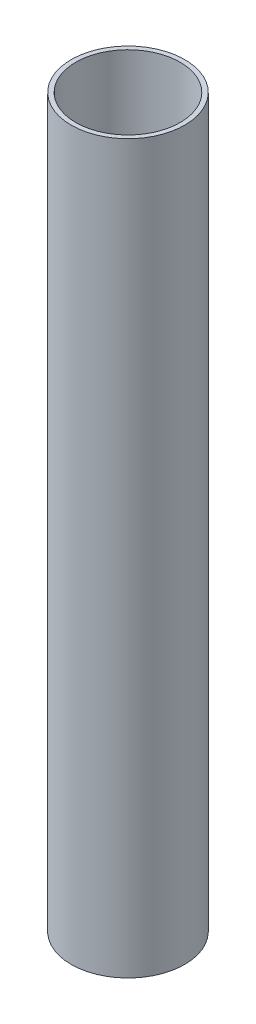
ISO-10303-21;
HEADER;
FILE_DESCRIPTION(('STEP AP214'),'2;1');
FILE_NAME('part.step','',(''),(''),'','','');
FILE_SCHEMA(('AUTOMOTIVE_DESIGN { 1 0 10303 214 1 1 1 1 }'));
ENDSEC;
DATA;
#1=APPLICATION_CONTEXT('core data for automotive mechanical design processes');
#2=APPLICATION_PROTOCOL_DEFINITION('international standard','automotive_design',2000,#1);
#3=PRODUCT_CONTEXT('',#1,'mechanical');
#4=PRODUCT('Part','Part','',(#3));
#5=PRODUCT_RELATED_PRODUCT_CATEGORY('part','',(#4));
#6=PRODUCT_DEFINITION_FORMATION('','',#4);
#7=PRODUCT_DEFINITION_CONTEXT('part definition',#1,'design');
#8=PRODUCT_DEFINITION('design','',#6,#7);
#9=PRODUCT_DEFINITION_SHAPE('','',#8);
#10=(LENGTH_UNIT() NAMED_UNIT(*) SI_UNIT(.MILLI.,.METRE.));
#11=(NAMED_UNIT(*) PLANE_ANGLE_UNIT() SI_UNIT($,.RADIAN.));
#12=(NAMED_UNIT(*) SI_UNIT($,.STERADIAN.) SOLID_ANGLE_UNIT());
#13=UNCERTAINTY_MEASURE_WITH_UNIT(LENGTH_MEASURE(1.E-05),#10,'distance_accuracy_value','');
#14=(GEOMETRIC_REPRESENTATION_CONTEXT(3) GLOBAL_UNCERTAINTY_ASSIGNED_CONTEXT((#13)) GLOBAL_UNIT_ASSIGNED_CONTEXT((#10,
#11,#12)) REPRESENTATION_CONTEXT('',''));
#15=CARTESIAN_POINT('',(0.,0.,0.));
#16=DIRECTION('',(0.,0.,1.));
#17=DIRECTION('',(1.,0.,0.));
#18=AXIS2_PLACEMENT_3D('',#15,#16,#17);
#19=CARTESIAN_POINT('',(0.,160.,0.));
#20=DIRECTION('',(0.,1.,0.));
#21=DIRECTION('',(0.,0.,1.));
#22=AXIS2_PLACEMENT_3D('',#19,#20,#21);
#23=PLANE('',#22);
#24=CARTESIAN_POINT('',(0.,160.,0.));
#25=DIRECTION('',(0.,1.,0.));
#26=DIRECTION('',(0.,0.,1.));
#27=AXIS2_PLACEMENT_3D('',#24,#25,#26);
#28=CIRCLE('',#27,12.5);
#29=CARTESIAN_POINT('',(0.,160.,12.5));
#30=VERTEX_POINT('',#29);
#31=EDGE_CURVE('E10',#30,#30,#28,.T.);
#32=ORIENTED_EDGE('',*,*,#31,.T.);
#33=EDGE_LOOP('',(#32));
#34=FACE_BOUND('',#33,.T.);
#35=CARTESIAN_POINT('',(0.,160.,0.));
#36=DIRECTION('',(0.,1.,0.));
#37=DIRECTION('',(0.,0.,1.));
#38=AXIS2_PLACEMENT_3D('',#35,#36,#37);
#39=CIRCLE('',#38,11.5);
#40=CARTESIAN_POINT('',(0.,160.,11.5));
#41=VERTEX_POINT('',#40);
#42=EDGE_CURVE('E41',#41,#41,#39,.T.);
#43=ORIENTED_EDGE('',*,*,#42,.F.);
#44=EDGE_LOOP('',(#43));
#45=FACE_BOUND('',#44,.T.);
#46=ADVANCED_FACE('F30',(#34,#45),#23,.T.);
#47=CARTESIAN_POINT('',(0.,0.,0.));
#48=DIRECTION('',(0.,1.,0.));
#49=DIRECTION('',(0.,0.,1.));
#50=AXIS2_PLACEMENT_3D('',#47,#48,#49);
#51=PLANE('',#50);
#52=CARTESIAN_POINT('',(0.,0.,0.));
#53=DIRECTION('',(0.,1.,0.));
#54=DIRECTION('',(0.,0.,1.));
#55=AXIS2_PLACEMENT_3D('',#52,#53,#54);
#56=CIRCLE('',#55,12.5);
#57=CARTESIAN_POINT('',(0.,0.,12.5));
#58=VERTEX_POINT('',#57);
#59=EDGE_CURVE('E34',#58,#58,#56,.T.);
#60=ORIENTED_EDGE('',*,*,#59,.F.);
#61=EDGE_LOOP('',(#60));
#62=FACE_BOUND('',#61,.T.);
#63=CARTESIAN_POINT('',(0.,0.,0.));
#64=DIRECTION('',(0.,1.,0.));
#65=DIRECTION('',(0.,0.,1.));
#66=AXIS2_PLACEMENT_3D('',#63,#64,#65);
#67=CIRCLE('',#66,11.5);
#68=CARTESIAN_POINT('',(0.,0.,11.5));
#69=VERTEX_POINT('',#68);
#70=EDGE_CURVE('E43',#69,#69,#67,.T.);
#71=ORIENTED_EDGE('',*,*,#70,.T.);
#72=EDGE_LOOP('',(#71));
#73=FACE_BOUND('',#72,.T.);
#74=ADVANCED_FACE('F53',(#62,#73),#51,.F.);
#75=CARTESIAN_POINT('',(0.,160.,0.));
#76=DIRECTION('',(0.,-1.,0.));
#77=DIRECTION('',(0.,0.,-1.));
#78=AXIS2_PLACEMENT_3D('',#75,#76,#77);
#79=CYLINDRICAL_SURFACE('',#78,12.5);
#80=ORIENTED_EDGE('',*,*,#31,.F.);
#81=EDGE_LOOP('',(#80));
#82=FACE_BOUND('',#81,.T.);
#83=ORIENTED_EDGE('',*,*,#59,.T.);
#84=EDGE_LOOP('',(#83));
#85=FACE_BOUND('',#84,.T.);
#86=ADVANCED_FACE('F32',(#82,#85),#79,.T.);
#87=CARTESIAN_POINT('',(0.,160.,0.));
#88=DIRECTION('',(0.,-1.,0.));
#89=DIRECTION('',(0.,0.,-1.));
#90=AXIS2_PLACEMENT_3D('',#87,#88,#89);
#91=CYLINDRICAL_SURFACE('',#90,11.5);
#92=ORIENTED_EDGE('',*,*,#42,.T.);
#93=EDGE_LOOP('',(#92));
#94=FACE_BOUND('',#93,.T.);
#95=ORIENTED_EDGE('',*,*,#70,.F.);
#96=EDGE_LOOP('',(#95));
#97=FACE_BOUND('',#96,.T.);
#98=ADVANCED_FACE('F49',(#94,#97),#91,.F.);
#99=CLOSED_SHELL('',(#46,#74,#86,#98));
#100=MANIFOLD_SOLID_BREP('B2',#99);
#101=ADVANCED_BREP_SHAPE_REPRESENTATION('',(#18,#100),#14);
#102=SHAPE_DEFINITION_REPRESENTATION(#9,#101);
ENDSEC;
END-ISO-10303-21;
